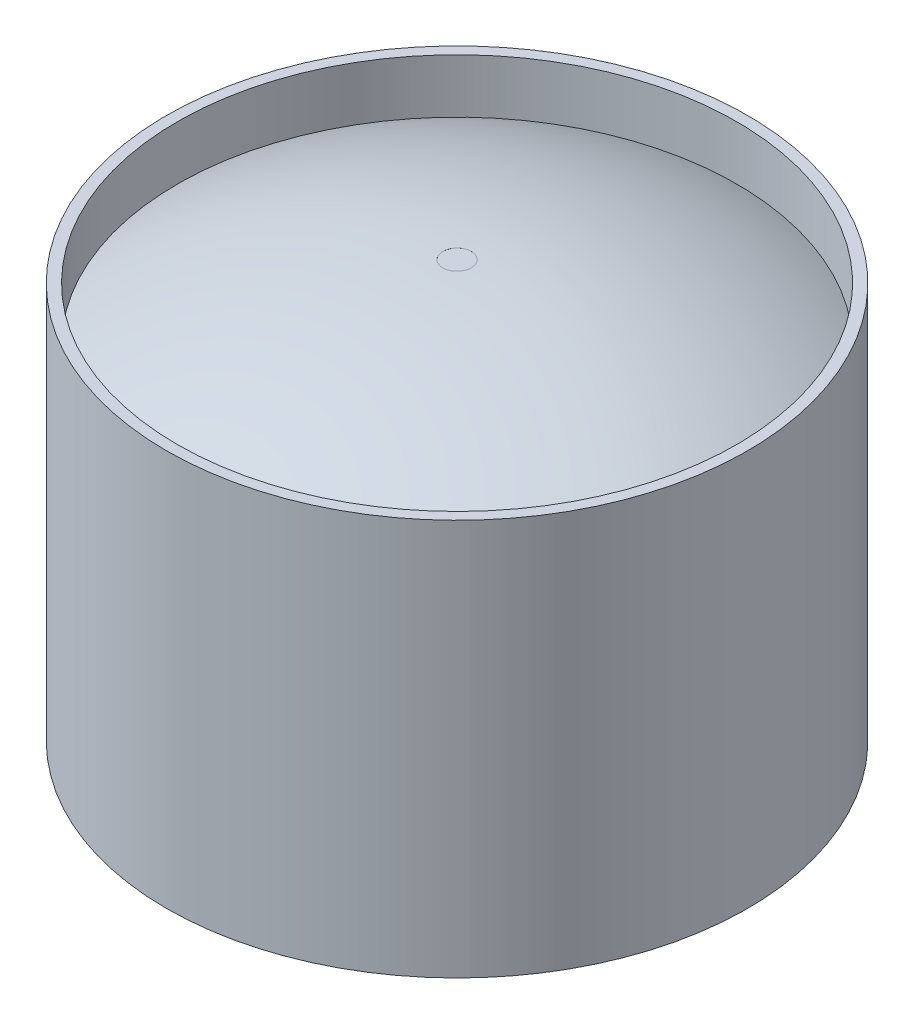
ISO-10303-21;
HEADER;
FILE_DESCRIPTION(('STEP AP214'),'2;1');
FILE_NAME('part.step','',(''),(''),'','','');
FILE_SCHEMA(('AUTOMOTIVE_DESIGN { 1 0 10303 214 1 1 1 1 }'));
ENDSEC;
DATA;
#1=APPLICATION_CONTEXT('core data for automotive mechanical design processes');
#2=APPLICATION_PROTOCOL_DEFINITION('international standard','automotive_design',2000,#1);
#3=PRODUCT_CONTEXT('',#1,'mechanical');
#4=PRODUCT('Part','Part','',(#3));
#5=PRODUCT_RELATED_PRODUCT_CATEGORY('part','',(#4));
#6=PRODUCT_DEFINITION_FORMATION('','',#4);
#7=PRODUCT_DEFINITION_CONTEXT('part definition',#1,'design');
#8=PRODUCT_DEFINITION('design','',#6,#7);
#9=PRODUCT_DEFINITION_SHAPE('','',#8);
#10=(LENGTH_UNIT() NAMED_UNIT(*) SI_UNIT(.MILLI.,.METRE.));
#11=(NAMED_UNIT(*) PLANE_ANGLE_UNIT() SI_UNIT($,.RADIAN.));
#12=(NAMED_UNIT(*) SI_UNIT($,.STERADIAN.) SOLID_ANGLE_UNIT());
#13=UNCERTAINTY_MEASURE_WITH_UNIT(LENGTH_MEASURE(1.E-05),#10,'distance_accuracy_value','');
#14=(GEOMETRIC_REPRESENTATION_CONTEXT(3) GLOBAL_UNCERTAINTY_ASSIGNED_CONTEXT((#13)) GLOBAL_UNIT_ASSIGNED_CONTEXT((#10,
#11,#12)) REPRESENTATION_CONTEXT('',''));
#15=CARTESIAN_POINT('',(0.,0.,0.));
#16=DIRECTION('',(0.,0.,1.));
#17=DIRECTION('',(1.,0.,0.));
#18=AXIS2_PLACEMENT_3D('',#15,#16,#17);
#19=CARTESIAN_POINT('',(0.,5.5,0.));
#20=DIRECTION('',(0.,-1.,0.));
#21=DIRECTION('',(0.,0.,-1.));
#22=AXIS2_PLACEMENT_3D('',#19,#20,#21);
#23=CYLINDRICAL_SURFACE('',#22,3.88065);
#24=CARTESIAN_POINT('',(0.,0.,0.));
#25=DIRECTION('',(0.,1.,0.));
#26=DIRECTION('',(0.,0.,1.));
#27=AXIS2_PLACEMENT_3D('',#24,#25,#26);
#28=CIRCLE('',#27,3.88065);
#29=CARTESIAN_POINT('',(0.,0.,3.88065));
#30=VERTEX_POINT('',#29);
#31=EDGE_CURVE('E53',#30,#30,#28,.T.);
#32=ORIENTED_EDGE('',*,*,#31,.F.);
#33=EDGE_LOOP('',(#32));
#34=FACE_BOUND('',#33,.T.);
#35=CARTESIAN_POINT('',(0.,0.75,0.));
#36=DIRECTION('',(0.,1.,0.));
#37=DIRECTION('',(0.,0.,1.));
#38=AXIS2_PLACEMENT_3D('',#35,#36,#37);
#39=CIRCLE('',#38,3.88065);
#40=CARTESIAN_POINT('',(0.,0.75,3.88065));
#41=VERTEX_POINT('',#40);
#42=EDGE_CURVE('E67',#41,#41,#39,.T.);
#43=ORIENTED_EDGE('',*,*,#42,.T.);
#44=EDGE_LOOP('',(#43));
#45=FACE_BOUND('',#44,.T.);
#46=ADVANCED_FACE('F36',(#34,#45),#23,.F.);
#47=CARTESIAN_POINT('',(0.,5.5,0.));
#48=DIRECTION('',(0.,1.,0.));
#49=DIRECTION('',(0.,0.,1.));
#50=AXIS2_PLACEMENT_3D('',#47,#48,#49);
#51=CIRCLE('',#50,3.88065);
#52=CARTESIAN_POINT('',(0.,5.5,3.88065));
#53=VERTEX_POINT('',#52);
#54=EDGE_CURVE('E51',#53,#53,#51,.T.);
#55=ORIENTED_EDGE('',*,*,#54,.T.);
#56=EDGE_LOOP('',(#55));
#57=FACE_BOUND('',#56,.T.);
#58=CARTESIAN_POINT('',(0.,4.75,0.));
#59=DIRECTION('',(0.,1.,0.));
#60=DIRECTION('',(0.,0.,1.));
#61=AXIS2_PLACEMENT_3D('',#58,#59,#60);
#62=CIRCLE('',#61,3.88065);
#63=CARTESIAN_POINT('',(0.,4.75,3.88065));
#64=VERTEX_POINT('',#63);
#65=EDGE_CURVE('E63',#64,#64,#62,.T.);
#66=ORIENTED_EDGE('',*,*,#65,.F.);
#67=EDGE_LOOP('',(#66));
#68=FACE_BOUND('',#67,.T.);
#69=ADVANCED_FACE('F96',(#57,#68),#23,.F.);
#70=CARTESIAN_POINT('',(0.,5.5,0.));
#71=DIRECTION('',(0.,1.,0.));
#72=DIRECTION('',(0.,0.,1.));
#73=AXIS2_PLACEMENT_3D('',#70,#71,#72);
#74=PLANE('',#73);
#75=CARTESIAN_POINT('',(0.,5.5,0.));
#76=DIRECTION('',(0.,1.,0.));
#77=DIRECTION('',(0.,0.,1.));
#78=AXIS2_PLACEMENT_3D('',#75,#76,#77);
#79=CIRCLE('',#78,4.03065);
#80=CARTESIAN_POINT('',(0.,5.5,4.03065));
#81=VERTEX_POINT('',#80);
#82=EDGE_CURVE('E10',#81,#81,#79,.T.);
#83=ORIENTED_EDGE('',*,*,#82,.T.);
#84=EDGE_LOOP('',(#83));
#85=FACE_BOUND('',#84,.T.);
#86=ORIENTED_EDGE('',*,*,#54,.F.);
#87=EDGE_LOOP('',(#86));
#88=FACE_BOUND('',#87,.T.);
#89=ADVANCED_FACE('F102',(#85,#88),#74,.T.);
#90=CARTESIAN_POINT('',(0.,0.,0.));
#91=DIRECTION('',(0.,1.,0.));
#92=DIRECTION('',(0.,0.,1.));
#93=AXIS2_PLACEMENT_3D('',#90,#91,#92);
#94=PLANE('',#93);
#95=CARTESIAN_POINT('',(0.,0.,0.));
#96=DIRECTION('',(0.,1.,0.));
#97=DIRECTION('',(0.,0.,1.));
#98=AXIS2_PLACEMENT_3D('',#95,#96,#97);
#99=CIRCLE('',#98,4.03065);
#100=CARTESIAN_POINT('',(0.,0.,4.03065));
#101=VERTEX_POINT('',#100);
#102=EDGE_CURVE('E40',#101,#101,#99,.T.);
#103=ORIENTED_EDGE('',*,*,#102,.F.);
#104=EDGE_LOOP('',(#103));
#105=FACE_BOUND('',#104,.T.);
#106=ORIENTED_EDGE('',*,*,#31,.T.);
#107=EDGE_LOOP('',(#106));
#108=FACE_BOUND('',#107,.T.);
#109=ADVANCED_FACE('F110',(#105,#108),#94,.F.);
#110=CARTESIAN_POINT('',(0.,5.5,0.));
#111=DIRECTION('',(0.,-1.,0.));
#112=DIRECTION('',(0.,0.,-1.));
#113=AXIS2_PLACEMENT_3D('',#110,#111,#112);
#114=CYLINDRICAL_SURFACE('',#113,4.03065);
#115=ORIENTED_EDGE('',*,*,#82,.F.);
#116=EDGE_LOOP('',(#115));
#117=FACE_BOUND('',#116,.T.);
#118=ORIENTED_EDGE('',*,*,#102,.T.);
#119=EDGE_LOOP('',(#118));
#120=FACE_BOUND('',#119,.T.);
#121=ADVANCED_FACE('F38',(#117,#120),#114,.T.);
#122=CARTESIAN_POINT('',(0.,11.9687959603956,0.));
#123=DIRECTION('',(0.,1.,0.));
#124=DIRECTION('',(0.,0.,1.));
#125=AXIS2_PLACEMENT_3D('',#122,#123,#124);
#126=DEGENERATE_TOROIDAL_SURFACE('',#125,0.321757309872835,11.9800505006891,.F.);
#127=ORIENTED_EDGE('',*,*,#42,.F.);
#128=EDGE_LOOP('',(#127));
#129=FACE_BOUND('',#128,.T.);
#130=CARTESIAN_POINT('',(0.,0.,0.));
#131=DIRECTION('',(0.,1.,0.));
#132=DIRECTION('',(0.,0.,1.));
#133=AXIS2_PLACEMENT_3D('',#130,#131,#132);
#134=CIRCLE('',#133,0.197408614932766);
#135=CARTESIAN_POINT('',(0.,0.,0.197408614932766));
#136=VERTEX_POINT('',#135);
#137=EDGE_CURVE('E74',#136,#136,#134,.T.);
#138=ORIENTED_EDGE('',*,*,#137,.T.);
#139=EDGE_LOOP('',(#138));
#140=FACE_BOUND('',#139,.T.);
#141=ADVANCED_FACE('F79',(#129,#140),#126,.F.);
#142=CARTESIAN_POINT('',(0.,5.5,0.));
#143=DIRECTION('',(0.,1.,0.));
#144=DIRECTION('',(0.,0.,1.));
#145=AXIS2_PLACEMENT_3D('',#142,#143,#144);
#146=CYLINDRICAL_SURFACE('',#145,0.197408614932766);
#147=CARTESIAN_POINT('',(0.,5.78159739039631,0.));
#148=DIRECTION('',(0.,1.,0.));
#149=DIRECTION('',(0.,0.,1.));
#150=AXIS2_PLACEMENT_3D('',#147,#148,#149);
#151=CIRCLE('',#150,0.197408614932766);
#152=CARTESIAN_POINT('',(0.,5.78159739039631,0.197408614932766));
#153=VERTEX_POINT('',#152);
#154=EDGE_CURVE('E70',#153,#153,#151,.T.);
#155=ORIENTED_EDGE('',*,*,#154,.F.);
#156=EDGE_LOOP('',(#155));
#157=FACE_BOUND('',#156,.T.);
#158=CARTESIAN_POINT('',(0.,5.78191747129151,0.));
#159=DIRECTION('',(0.,1.,0.));
#160=DIRECTION('',(0.,0.,1.));
#161=AXIS2_PLACEMENT_3D('',#158,#159,#160);
#162=CIRCLE('',#161,0.197408614932766);
#163=CARTESIAN_POINT('',(0.,5.78191747129151,0.197408614932766));
#164=VERTEX_POINT('',#163);
#165=EDGE_CURVE('E57',#164,#164,#162,.T.);
#166=ORIENTED_EDGE('',*,*,#165,.T.);
#167=EDGE_LOOP('',(#166));
#168=FACE_BOUND('',#167,.T.);
#169=ADVANCED_FACE('F92',(#157,#168),#146,.F.);
#170=CARTESIAN_POINT('',(0.,-1.65013498434125,0.));
#171=DIRECTION('',(0.,1.,0.));
#172=DIRECTION('',(0.,0.,1.));
#173=AXIS2_PLACEMENT_3D('',#170,#171,#172);
#174=DEGENERATE_TOROIDAL_SURFACE('',#173,0.101377875855463,7.43267284401276,.T.);
#175=ORIENTED_EDGE('',*,*,#165,.F.);
#176=EDGE_LOOP('',(#175));
#177=FACE_BOUND('',#176,.T.);
#178=ORIENTED_EDGE('',*,*,#65,.T.);
#179=EDGE_LOOP('',(#178));
#180=FACE_BOUND('',#179,.T.);
#181=ADVANCED_FACE('F84',(#177,#180),#174,.T.);
#182=CARTESIAN_POINT('',(0.,0.,0.));
#183=DIRECTION('',(0.,1.,0.));
#184=DIRECTION('',(0.,0.,1.));
#185=AXIS2_PLACEMENT_3D('',#182,#183,#184);
#186=PLANE('',#185);
#187=ORIENTED_EDGE('',*,*,#137,.F.);
#188=EDGE_LOOP('',(#187));
#189=FACE_BOUND('',#188,.T.);
#190=ADVANCED_FACE('F81',(#189),#186,.F.);
#191=CARTESIAN_POINT('',(0.,5.78159739039631,0.));
#192=DIRECTION('',(0.,1.,0.));
#193=DIRECTION('',(0.,0.,1.));
#194=AXIS2_PLACEMENT_3D('',#191,#192,#193);
#195=PLANE('',#194);
#196=ORIENTED_EDGE('',*,*,#154,.T.);
#197=EDGE_LOOP('',(#196));
#198=FACE_BOUND('',#197,.T.);
#199=ADVANCED_FACE('F83',(#198),#195,.T.);
#200=CLOSED_SHELL('',(#46,#69,#89,#109,#121,#141,#169,#181,#190,#199));
#201=MANIFOLD_SOLID_BREP('B2',#200);
#202=ADVANCED_BREP_SHAPE_REPRESENTATION('',(#18,#201),#14);
#203=SHAPE_DEFINITION_REPRESENTATION(#9,#202);
ENDSEC;
END-ISO-10303-21;
